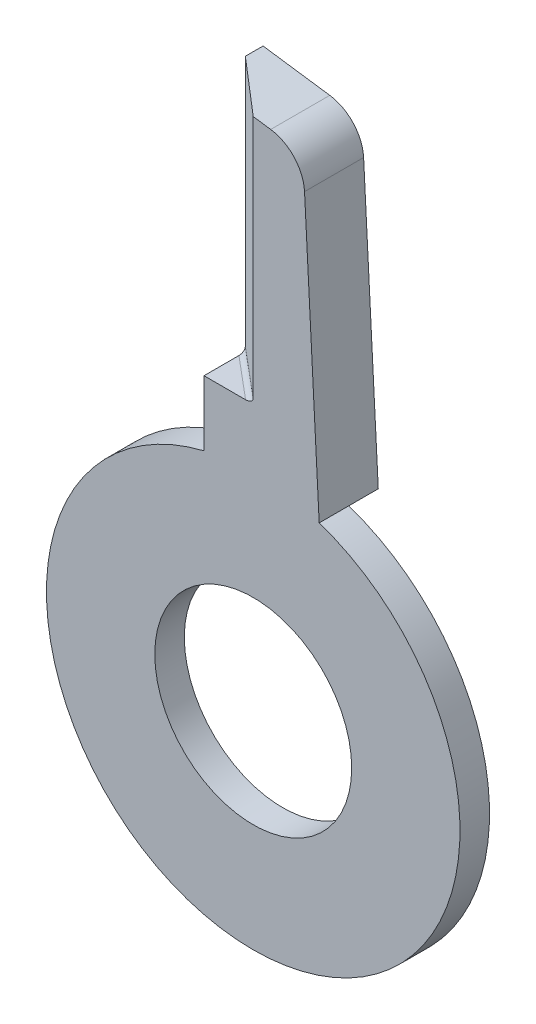
ISO-10303-21;
HEADER;
FILE_DESCRIPTION(('STEP AP214'),'2;1');
FILE_NAME('part.step','',(''),(''),'','','');
FILE_SCHEMA(('AUTOMOTIVE_DESIGN { 1 0 10303 214 1 1 1 1 }'));
ENDSEC;
DATA;
#1=APPLICATION_CONTEXT('core data for automotive mechanical design processes');
#2=APPLICATION_PROTOCOL_DEFINITION('international standard','automotive_design',2000,#1);
#3=PRODUCT_CONTEXT('',#1,'mechanical');
#4=PRODUCT('Part','Part','',(#3));
#5=PRODUCT_RELATED_PRODUCT_CATEGORY('part','',(#4));
#6=PRODUCT_DEFINITION_FORMATION('','',#4);
#7=PRODUCT_DEFINITION_CONTEXT('part definition',#1,'design');
#8=PRODUCT_DEFINITION('design','',#6,#7);
#9=PRODUCT_DEFINITION_SHAPE('','',#8);
#10=(LENGTH_UNIT() NAMED_UNIT(*) SI_UNIT(.MILLI.,.METRE.));
#11=(NAMED_UNIT(*) PLANE_ANGLE_UNIT() SI_UNIT($,.RADIAN.));
#12=(NAMED_UNIT(*) SI_UNIT($,.STERADIAN.) SOLID_ANGLE_UNIT());
#13=UNCERTAINTY_MEASURE_WITH_UNIT(LENGTH_MEASURE(1.E-05),#10,'distance_accuracy_value','');
#14=(GEOMETRIC_REPRESENTATION_CONTEXT(3) GLOBAL_UNCERTAINTY_ASSIGNED_CONTEXT((#13)) GLOBAL_UNIT_ASSIGNED_CONTEXT((#10,
#11,#12)) REPRESENTATION_CONTEXT('',''));
#15=CARTESIAN_POINT('',(0.,0.,0.));
#16=DIRECTION('',(0.,0.,1.));
#17=DIRECTION('',(1.,0.,0.));
#18=AXIS2_PLACEMENT_3D('',#15,#16,#17);
#19=CARTESIAN_POINT('',(0.,0.,6.));
#20=DIRECTION('',(0.,0.,-1.));
#21=DIRECTION('',(-1.,0.,0.));
#22=AXIS2_PLACEMENT_3D('',#19,#20,#21);
#23=CYLINDRICAL_SURFACE('',#22,21.);
#24=CARTESIAN_POINT('',(0.,0.,3.));
#25=DIRECTION('',(0.,0.,-1.));
#26=DIRECTION('',(-1.,0.,0.));
#27=AXIS2_PLACEMENT_3D('',#24,#25,#26);
#28=CIRCLE('',#27,21.);
#29=CARTESIAN_POINT('',(6.70000000000001,19.9025124042167,3.));
#30=VERTEX_POINT('',#29);
#31=CARTESIAN_POINT('',(-4.99999999999999,20.3960780543711,3.));
#32=VERTEX_POINT('',#31);
#33=EDGE_CURVE('E167',#30,#32,#28,.T.);
#34=ORIENTED_EDGE('',*,*,#33,.F.);
#35=DIRECTION('',(0.,0.,-1.));
#36=VECTOR('',#35,1.);
#37=CARTESIAN_POINT('',(6.70000000000001,19.9025124042167,6.));
#38=LINE('',#37,#36);
#39=CARTESIAN_POINT('',(6.70000000000001,19.9025124042167,6.));
#40=VERTEX_POINT('',#39);
#41=EDGE_CURVE('E152',#40,#30,#38,.T.);
#42=ORIENTED_EDGE('',*,*,#41,.F.);
#43=CARTESIAN_POINT('',(0.,0.,6.));
#44=DIRECTION('',(0.,0.,1.));
#45=DIRECTION('',(1.,0.,0.));
#46=AXIS2_PLACEMENT_3D('',#43,#44,#45);
#47=CIRCLE('',#46,21.);
#48=CARTESIAN_POINT('',(-4.99999999999999,20.3960780543711,6.));
#49=VERTEX_POINT('',#48);
#50=EDGE_CURVE('E142',#49,#40,#47,.T.);
#51=ORIENTED_EDGE('',*,*,#50,.F.);
#52=DIRECTION('',(0.,0.,-1.));
#53=VECTOR('',#52,1.);
#54=CARTESIAN_POINT('',(-4.99999999999999,20.3960780543711,6.));
#55=LINE('',#54,#53);
#56=EDGE_CURVE('E121',#49,#32,#55,.T.);
#57=ORIENTED_EDGE('',*,*,#56,.T.);
#58=EDGE_LOOP('',(#34,#42,#51,#57));
#59=FACE_BOUND('',#58,.T.);
#60=ADVANCED_FACE('F32',(#59),#23,.T.);
#61=CARTESIAN_POINT('',(0.,0.,6.));
#62=DIRECTION('',(0.,0.,-1.));
#63=DIRECTION('',(-1.,0.,0.));
#64=AXIS2_PLACEMENT_3D('',#61,#62,#63);
#65=CYLINDRICAL_SURFACE('',#64,10.);
#66=CARTESIAN_POINT('',(0.,0.,6.));
#67=DIRECTION('',(0.,0.,1.));
#68=DIRECTION('',(1.,0.,0.));
#69=AXIS2_PLACEMENT_3D('',#66,#67,#68);
#70=CIRCLE('',#69,10.);
#71=CARTESIAN_POINT('',(10.,0.,6.));
#72=VERTEX_POINT('',#71);
#73=EDGE_CURVE('E135',#72,#72,#70,.T.);
#74=ORIENTED_EDGE('',*,*,#73,.T.);
#75=EDGE_LOOP('',(#74));
#76=FACE_BOUND('',#75,.T.);
#77=CARTESIAN_POINT('',(0.,0.,3.));
#78=DIRECTION('',(0.,0.,-1.));
#79=DIRECTION('',(-1.,0.,0.));
#80=AXIS2_PLACEMENT_3D('',#77,#78,#79);
#81=CIRCLE('',#80,10.);
#82=CARTESIAN_POINT('',(-10.,0.,3.));
#83=VERTEX_POINT('',#82);
#84=EDGE_CURVE('E173',#83,#83,#81,.T.);
#85=ORIENTED_EDGE('',*,*,#84,.T.);
#86=EDGE_LOOP('',(#85));
#87=FACE_BOUND('',#86,.T.);
#88=ADVANCED_FACE('F207',(#76,#87),#65,.F.);
#89=CARTESIAN_POINT('',(0.,0.,6.));
#90=DIRECTION('',(0.,0.,1.));
#91=DIRECTION('',(1.,0.,0.));
#92=AXIS2_PLACEMENT_3D('',#89,#90,#91);
#93=PLANE('',#92);
#94=DIRECTION('',(0.,1.,0.));
#95=VECTOR('',#94,1.);
#96=CARTESIAN_POINT('',(0.,27.,6.));
#97=LINE('',#96,#95);
#98=CARTESIAN_POINT('',(0.,27.5,6.));
#99=VERTEX_POINT('',#98);
#100=CARTESIAN_POINT('',(0.,52.297295826488,6.));
#101=VERTEX_POINT('',#100);
#102=EDGE_CURVE('E108',#99,#101,#97,.T.);
#103=ORIENTED_EDGE('',*,*,#102,.F.);
#104=CARTESIAN_POINT('',(-0.777372748443546,27.5,6.));
#105=DIRECTION('',(0.,0.,1.));
#106=DIRECTION('',(1.,0.,0.));
#107=AXIS2_PLACEMENT_3D('',#104,#105,#106);
#108=ELLIPSE('',#107,0.777372748443548,0.5);
#109=CARTESIAN_POINT('',(-0.777372748443547,27.,6.));
#110=VERTEX_POINT('',#109);
#111=EDGE_CURVE('E11',#99,#110,#108,.F.);
#112=ORIENTED_EDGE('',*,*,#111,.T.);
#113=DIRECTION('',(1.,0.,0.));
#114=VECTOR('',#113,1.);
#115=CARTESIAN_POINT('',(0.,27.,6.));
#116=LINE('',#115,#114);
#117=CARTESIAN_POINT('',(-5.,27.,6.));
#118=VERTEX_POINT('',#117);
#119=EDGE_CURVE('E104',#118,#110,#116,.T.);
#120=ORIENTED_EDGE('',*,*,#119,.F.);
#121=DIRECTION('',(0.,-1.,0.));
#122=VECTOR('',#121,1.);
#123=CARTESIAN_POINT('',(-4.99999999999999,20.3960780543711,6.));
#124=LINE('',#123,#122);
#125=EDGE_CURVE('E114',#118,#49,#124,.T.);
#126=ORIENTED_EDGE('',*,*,#125,.T.);
#127=ORIENTED_EDGE('',*,*,#50,.T.);
#128=DIRECTION('',(-0.0523359562429374,0.998629534754574,0.));
#129=VECTOR('',#128,1.);
#130=CARTESIAN_POINT('',(5.21194827782318,48.2962307134858,6.));
#131=LINE('',#130,#129);
#132=CARTESIAN_POINT('',(5.21194827782318,48.2962307134858,6.));
#133=VERTEX_POINT('',#132);
#134=EDGE_CURVE('E163',#40,#133,#131,.T.);
#135=ORIENTED_EDGE('',*,*,#134,.T.);
#136=CARTESIAN_POINT('',(1.21743013880488,48.0868868885141,6.));
#137=DIRECTION('',(0.,0.,1.));
#138=DIRECTION('',(-1.,0.,0.));
#139=AXIS2_PLACEMENT_3D('',#136,#137,#138);
#140=CIRCLE('',#139,4.);
#141=CARTESIAN_POINT('',(1.77412254264513,52.0479591634803,6.));
#142=VERTEX_POINT('',#141);
#143=EDGE_CURVE('E128',#133,#142,#140,.T.);
#144=ORIENTED_EDGE('',*,*,#143,.T.);
#145=DIRECTION('',(-0.99026806874157,0.139173100960068,0.));
#146=VECTOR('',#145,1.);
#147=CARTESIAN_POINT('',(-5.,53.,6.));
#148=LINE('',#147,#146);
#149=EDGE_CURVE('E124',#142,#101,#148,.T.);
#150=ORIENTED_EDGE('',*,*,#149,.T.);
#151=EDGE_LOOP('',(#103,#112,#120,#126,#127,#135,#144,#150));
#152=FACE_BOUND('',#151,.T.);
#153=ORIENTED_EDGE('',*,*,#73,.F.);
#154=EDGE_LOOP('',(#153));
#155=FACE_BOUND('',#154,.T.);
#156=ADVANCED_FACE('F111',(#152,#155),#93,.T.);
#157=CARTESIAN_POINT('',(0.,0.,0.));
#158=DIRECTION('',(0.,0.,1.));
#159=DIRECTION('',(1.,0.,0.));
#160=AXIS2_PLACEMENT_3D('',#157,#158,#159);
#161=PLANE('',#160);
#162=DIRECTION('',(-0.0523359562429374,0.998629534754574,0.));
#163=VECTOR('',#162,1.);
#164=CARTESIAN_POINT('',(5.21194827782318,48.2962307134858,0.));
#165=LINE('',#164,#163);
#166=CARTESIAN_POINT('',(6.70000000000001,19.9025124042167,0.));
#167=VERTEX_POINT('',#166);
#168=CARTESIAN_POINT('',(5.21194827782318,48.2962307134858,0.));
#169=VERTEX_POINT('',#168);
#170=EDGE_CURVE('E132',#167,#169,#165,.T.);
#171=ORIENTED_EDGE('',*,*,#170,.F.);
#172=CARTESIAN_POINT('',(0.,0.,0.));
#173=DIRECTION('',(0.,0.,-1.));
#174=DIRECTION('',(-1.,0.,0.));
#175=AXIS2_PLACEMENT_3D('',#172,#173,#174);
#176=CIRCLE('',#175,21.);
#177=CARTESIAN_POINT('',(-4.99999999999999,20.3960780543711,0.));
#178=VERTEX_POINT('',#177);
#179=EDGE_CURVE('E171',#178,#167,#176,.T.);
#180=ORIENTED_EDGE('',*,*,#179,.F.);
#181=DIRECTION('',(0.,-1.,0.));
#182=VECTOR('',#181,1.);
#183=CARTESIAN_POINT('',(-4.99999999999999,20.3960780543711,0.));
#184=LINE('',#183,#182);
#185=CARTESIAN_POINT('',(-5.,53.,0.));
#186=VERTEX_POINT('',#185);
#187=EDGE_CURVE('E140',#186,#178,#184,.T.);
#188=ORIENTED_EDGE('',*,*,#187,.F.);
#189=DIRECTION('',(-0.99026806874157,0.139173100960068,0.));
#190=VECTOR('',#189,1.);
#191=CARTESIAN_POINT('',(-5.,53.,0.));
#192=LINE('',#191,#190);
#193=CARTESIAN_POINT('',(1.77412254264513,52.0479591634803,0.));
#194=VERTEX_POINT('',#193);
#195=EDGE_CURVE('E137',#194,#186,#192,.T.);
#196=ORIENTED_EDGE('',*,*,#195,.F.);
#197=CARTESIAN_POINT('',(1.21743013880488,48.0868868885141,0.));
#198=DIRECTION('',(0.,0.,1.));
#199=DIRECTION('',(-1.,0.,0.));
#200=AXIS2_PLACEMENT_3D('',#197,#198,#199);
#201=CIRCLE('',#200,4.);
#202=EDGE_CURVE('E134',#169,#194,#201,.T.);
#203=ORIENTED_EDGE('',*,*,#202,.F.);
#204=EDGE_LOOP('',(#171,#180,#188,#196,#203));
#205=FACE_BOUND('',#204,.T.);
#206=ADVANCED_FACE('F216',(#205),#161,.F.);
#207=CARTESIAN_POINT('',(5.21194827782318,48.2962307134858,6.));
#208=DIRECTION('',(-0.998629534754574,-0.0523359562429374,0.));
#209=DIRECTION('',(0.0523359562429374,-0.998629534754574,0.));
#210=AXIS2_PLACEMENT_3D('',#207,#208,#209);
#211=PLANE('',#210);
#212=ORIENTED_EDGE('',*,*,#170,.T.);
#213=DIRECTION('',(0.,0.,-1.));
#214=VECTOR('',#213,1.);
#215=CARTESIAN_POINT('',(5.21194827782318,48.2962307134858,6.));
#216=LINE('',#215,#214);
#217=EDGE_CURVE('E149',#133,#169,#216,.T.);
#218=ORIENTED_EDGE('',*,*,#217,.F.);
#219=ORIENTED_EDGE('',*,*,#134,.F.);
#220=ORIENTED_EDGE('',*,*,#41,.T.);
#221=DIRECTION('',(0.,0.,-1.));
#222=VECTOR('',#221,1.);
#223=CARTESIAN_POINT('',(6.70000000000001,19.9025124042167,3.));
#224=LINE('',#223,#222);
#225=EDGE_CURVE('E160',#30,#167,#224,.T.);
#226=ORIENTED_EDGE('',*,*,#225,.T.);
#227=EDGE_LOOP('',(#212,#218,#219,#220,#226));
#228=FACE_BOUND('',#227,.T.);
#229=ADVANCED_FACE('F159',(#228),#211,.F.);
#230=CARTESIAN_POINT('',(1.21743013880488,48.0868868885141,6.));
#231=DIRECTION('',(0.,0.,-1.));
#232=DIRECTION('',(-1.,0.,0.));
#233=AXIS2_PLACEMENT_3D('',#230,#231,#232);
#234=CYLINDRICAL_SURFACE('',#233,4.);
#235=ORIENTED_EDGE('',*,*,#202,.T.);
#236=DIRECTION('',(0.,0.,-1.));
#237=VECTOR('',#236,1.);
#238=CARTESIAN_POINT('',(1.77412254264513,52.0479591634803,6.));
#239=LINE('',#238,#237);
#240=EDGE_CURVE('E146',#142,#194,#239,.T.);
#241=ORIENTED_EDGE('',*,*,#240,.F.);
#242=ORIENTED_EDGE('',*,*,#143,.F.);
#243=ORIENTED_EDGE('',*,*,#217,.T.);
#244=EDGE_LOOP('',(#235,#241,#242,#243));
#245=FACE_BOUND('',#244,.T.);
#246=ADVANCED_FACE('F186',(#245),#234,.T.);
#247=CARTESIAN_POINT('',(-5.,53.,6.));
#248=DIRECTION('',(-0.139173100960068,-0.99026806874157,0.));
#249=DIRECTION('',(0.99026806874157,-0.139173100960068,0.));
#250=AXIS2_PLACEMENT_3D('',#247,#248,#249);
#251=PLANE('',#250);
#252=DIRECTION('',(0.,0.,-1.));
#253=VECTOR('',#252,1.);
#254=CARTESIAN_POINT('',(-5.,53.,6.));
#255=LINE('',#254,#253);
#256=CARTESIAN_POINT('',(-5.,53.,1.8));
#257=VERTEX_POINT('',#256);
#258=EDGE_CURVE('E144',#257,#186,#255,.T.);
#259=ORIENTED_EDGE('',*,*,#258,.F.);
#260=DIRECTION('',(0.761309376374689,-0.106995055222458,0.639499876154738));
#261=VECTOR('',#260,1.);
#262=CARTESIAN_POINT('',(-2.95519954199037,52.7126220368315,3.51763238472809));
#263=LINE('',#262,#261);
#264=EDGE_CURVE('E194',#257,#101,#263,.T.);
#265=ORIENTED_EDGE('',*,*,#264,.T.);
#266=ORIENTED_EDGE('',*,*,#149,.F.);
#267=ORIENTED_EDGE('',*,*,#240,.T.);
#268=ORIENTED_EDGE('',*,*,#195,.T.);
#269=EDGE_LOOP('',(#259,#265,#266,#267,#268));
#270=FACE_BOUND('',#269,.T.);
#271=ADVANCED_FACE('F192',(#270),#251,.F.);
#272=CARTESIAN_POINT('',(-4.99999999999999,20.3960780543711,6.));
#273=DIRECTION('',(1.,0.,0.));
#274=DIRECTION('',(0.,1.,0.));
#275=AXIS2_PLACEMENT_3D('',#272,#273,#274);
#276=PLANE('',#275);
#277=DIRECTION('',(0.,0.,1.));
#278=VECTOR('',#277,1.);
#279=CARTESIAN_POINT('',(-5.,27.,6.));
#280=LINE('',#279,#278);
#281=CARTESIAN_POINT('',(-5.,27.,2.45299310869258));
#282=VERTEX_POINT('',#281);
#283=EDGE_CURVE('E101',#282,#118,#280,.T.);
#284=ORIENTED_EDGE('',*,*,#283,.F.);
#285=CARTESIAN_POINT('',(-4.99999999999999,27.5,2.45299310869258));
#286=DIRECTION('',(1.,0.,0.));
#287=DIRECTION('',(0.,0.,1.));
#288=AXIS2_PLACEMENT_3D('',#285,#286,#287);
#289=ELLIPSE('',#288,0.65299310869258,0.5);
#290=CARTESIAN_POINT('',(-5.,27.5,1.8));
#291=VERTEX_POINT('',#290);
#292=EDGE_CURVE('E40',#282,#291,#289,.T.);
#293=ORIENTED_EDGE('',*,*,#292,.T.);
#294=DIRECTION('',(0.,1.,0.));
#295=VECTOR('',#294,1.);
#296=CARTESIAN_POINT('',(-5.,27.,1.8));
#297=LINE('',#296,#295);
#298=EDGE_CURVE('E195',#291,#257,#297,.T.);
#299=ORIENTED_EDGE('',*,*,#298,.T.);
#300=ORIENTED_EDGE('',*,*,#258,.T.);
#301=ORIENTED_EDGE('',*,*,#187,.T.);
#302=EDGE_CURVE('E123',#32,#178,#55,.T.);
#303=ORIENTED_EDGE('',*,*,#302,.F.);
#304=ORIENTED_EDGE('',*,*,#56,.F.);
#305=ORIENTED_EDGE('',*,*,#125,.F.);
#306=EDGE_LOOP('',(#284,#293,#299,#300,#301,#303,#304,#305));
#307=FACE_BOUND('',#306,.T.);
#308=ADVANCED_FACE('F118',(#307),#276,.F.);
#309=CARTESIAN_POINT('',(0.,0.,3.));
#310=DIRECTION('',(0.,0.,-1.));
#311=DIRECTION('',(-1.,0.,0.));
#312=AXIS2_PLACEMENT_3D('',#309,#310,#311);
#313=CYLINDRICAL_SURFACE('',#312,21.);
#314=EDGE_CURVE('E170',#32,#30,#28,.T.);
#315=ORIENTED_EDGE('',*,*,#314,.F.);
#316=ORIENTED_EDGE('',*,*,#302,.T.);
#317=ORIENTED_EDGE('',*,*,#179,.T.);
#318=ORIENTED_EDGE('',*,*,#225,.F.);
#319=EDGE_LOOP('',(#315,#316,#317,#318));
#320=FACE_BOUND('',#319,.T.);
#321=ADVANCED_FACE('F223',(#320),#313,.F.);
#322=CARTESIAN_POINT('',(0.,0.,3.));
#323=DIRECTION('',(0.,0.,-1.));
#324=DIRECTION('',(-1.,0.,0.));
#325=AXIS2_PLACEMENT_3D('',#322,#323,#324);
#326=PLANE('',#325);
#327=ORIENTED_EDGE('',*,*,#84,.F.);
#328=EDGE_LOOP('',(#327));
#329=FACE_BOUND('',#328,.T.);
#330=ORIENTED_EDGE('',*,*,#314,.T.);
#331=ORIENTED_EDGE('',*,*,#33,.T.);
#332=EDGE_LOOP('',(#330,#331));
#333=FACE_BOUND('',#332,.T.);
#334=ADVANCED_FACE('F231',(#329,#333),#326,.T.);
#335=CARTESIAN_POINT('',(-5.,27.,1.8));
#336=DIRECTION('',(0.643192086423273,0.,-0.765704864789611));
#337=DIRECTION('',(-0.765704864789611,0.,-0.643192086423273));
#338=AXIS2_PLACEMENT_3D('',#335,#336,#337);
#339=PLANE('',#338);
#340=ORIENTED_EDGE('',*,*,#298,.F.);
#341=DIRECTION('',(-0.765704864789611,0.,-0.643192086423273));
#342=VECTOR('',#341,1.);
#343=CARTESIAN_POINT('',(0.,27.5,6.));
#344=LINE('',#343,#342);
#345=EDGE_CURVE('E47',#291,#99,#344,.F.);
#346=ORIENTED_EDGE('',*,*,#345,.T.);
#347=ORIENTED_EDGE('',*,*,#102,.T.);
#348=ORIENTED_EDGE('',*,*,#264,.F.);
#349=EDGE_LOOP('',(#340,#346,#347,#348));
#350=FACE_BOUND('',#349,.T.);
#351=ADVANCED_FACE('F199',(#350),#339,.F.);
#352=CARTESIAN_POINT('',(-5.,27.,6.));
#353=DIRECTION('',(0.,-1.,0.));
#354=DIRECTION('',(0.,0.,-1.));
#355=AXIS2_PLACEMENT_3D('',#352,#353,#354);
#356=PLANE('',#355);
#357=ORIENTED_EDGE('',*,*,#119,.T.);
#358=DIRECTION('',(-0.765704864789611,0.,-0.643192086423273));
#359=VECTOR('',#358,1.);
#360=CARTESIAN_POINT('',(-5.32159604321163,27.,2.18285243239481));
#361=LINE('',#360,#359);
#362=EDGE_CURVE('E106',#110,#282,#361,.T.);
#363=ORIENTED_EDGE('',*,*,#362,.T.);
#364=ORIENTED_EDGE('',*,*,#283,.T.);
#365=EDGE_LOOP('',(#357,#363,#364));
#366=FACE_BOUND('',#365,.T.);
#367=ADVANCED_FACE('F103',(#366),#356,.F.);
#368=CARTESIAN_POINT('',(-3.25311574302402,27.5,3.9203758845524));
#369=DIRECTION('',(0.765704864789611,0.,0.643192086423273));
#370=DIRECTION('',(0.643192086423273,0.,-0.765704864789611));
#371=AXIS2_PLACEMENT_3D('',#368,#369,#370);
#372=CYLINDRICAL_SURFACE('',#371,0.5);
#373=ORIENTED_EDGE('',*,*,#111,.F.);
#374=ORIENTED_EDGE('',*,*,#345,.F.);
#375=ORIENTED_EDGE('',*,*,#292,.F.);
#376=ORIENTED_EDGE('',*,*,#362,.F.);
#377=EDGE_LOOP('',(#373,#374,#375,#376));
#378=FACE_BOUND('',#377,.T.);
#379=ADVANCED_FACE('F34',(#378),#372,.F.);
#380=CLOSED_SHELL('',(#60,#88,#156,#206,#229,#246,#271,#308,#321,#334,#351,#367,#379));
#381=MANIFOLD_SOLID_BREP('B2',#380);
#382=ADVANCED_BREP_SHAPE_REPRESENTATION('',(#18,#381),#14);
#383=SHAPE_DEFINITION_REPRESENTATION(#9,#382);
ENDSEC;
END-ISO-10303-21;
